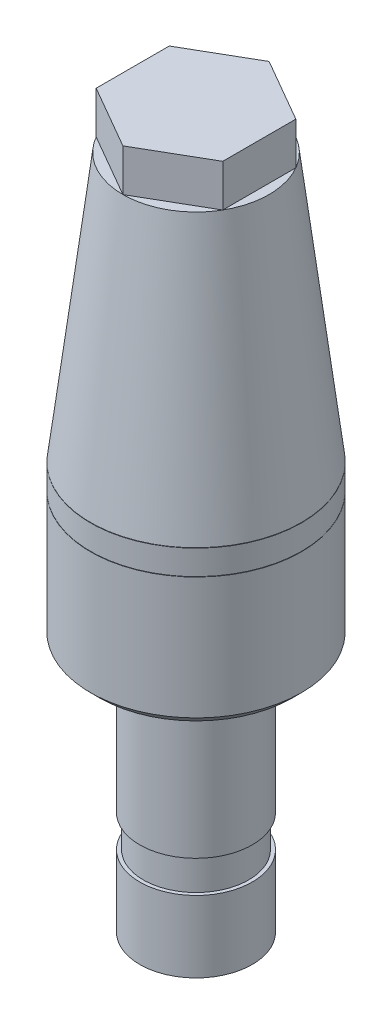
ISO-10303-21;
HEADER;
FILE_DESCRIPTION(('STEP AP214'),'2;1');
FILE_NAME('part.step','',(''),(''),'','','');
FILE_SCHEMA(('AUTOMOTIVE_DESIGN { 1 0 10303 214 1 1 1 1 }'));
ENDSEC;
DATA;
#1=APPLICATION_CONTEXT('core data for automotive mechanical design processes');
#2=APPLICATION_PROTOCOL_DEFINITION('international standard','automotive_design',2000,#1);
#3=PRODUCT_CONTEXT('',#1,'mechanical');
#4=PRODUCT('Part','Part','',(#3));
#5=PRODUCT_RELATED_PRODUCT_CATEGORY('part','',(#4));
#6=PRODUCT_DEFINITION_FORMATION('','',#4);
#7=PRODUCT_DEFINITION_CONTEXT('part definition',#1,'design');
#8=PRODUCT_DEFINITION('design','',#6,#7);
#9=PRODUCT_DEFINITION_SHAPE('','',#8);
#10=(LENGTH_UNIT() NAMED_UNIT(*) SI_UNIT(.MILLI.,.METRE.));
#11=(NAMED_UNIT(*) PLANE_ANGLE_UNIT() SI_UNIT($,.RADIAN.));
#12=(NAMED_UNIT(*) SI_UNIT($,.STERADIAN.) SOLID_ANGLE_UNIT());
#13=UNCERTAINTY_MEASURE_WITH_UNIT(LENGTH_MEASURE(1.E-05),#10,'distance_accuracy_value','');
#14=(GEOMETRIC_REPRESENTATION_CONTEXT(3) GLOBAL_UNCERTAINTY_ASSIGNED_CONTEXT((#13)) GLOBAL_UNIT_ASSIGNED_CONTEXT((#10,
#11,#12)) REPRESENTATION_CONTEXT('',''));
#15=CARTESIAN_POINT('',(0.,0.,0.));
#16=DIRECTION('',(0.,0.,1.));
#17=DIRECTION('',(1.,0.,0.));
#18=AXIS2_PLACEMENT_3D('',#15,#16,#17);
#19=CARTESIAN_POINT('',(4.5,22.5,-2.59807621135331));
#20=DIRECTION('',(0.499999999999999,0.,-0.866025403784439));
#21=DIRECTION('',(-0.866025403784439,0.,-0.499999999999999));
#22=AXIS2_PLACEMENT_3D('',#19,#20,#21);
#23=PLANE('',#22);
#24=DIRECTION('',(-0.866025403784439,0.,-0.499999999999999));
#25=VECTOR('',#24,1.);
#26=CARTESIAN_POINT('',(4.5,25.5,-2.59807621135331));
#27=LINE('',#26,#25);
#28=CARTESIAN_POINT('',(4.5,25.5,-2.59807621135331));
#29=VERTEX_POINT('',#28);
#30=CARTESIAN_POINT('',(0.,25.5,-5.19615242270662));
#31=VERTEX_POINT('',#30);
#32=EDGE_CURVE('E148',#29,#31,#27,.T.);
#33=ORIENTED_EDGE('',*,*,#32,.F.);
#34=DIRECTION('',(0.,1.,0.));
#35=VECTOR('',#34,1.);
#36=CARTESIAN_POINT('',(4.5,22.5,-2.59807621135331));
#37=LINE('',#36,#35);
#38=CARTESIAN_POINT('',(4.5,22.5,-2.59807621135331));
#39=VERTEX_POINT('',#38);
#40=EDGE_CURVE('E12',#39,#29,#37,.T.);
#41=ORIENTED_EDGE('',*,*,#40,.F.);
#42=DIRECTION('',(-0.866025403784439,0.,-0.499999999999999));
#43=VECTOR('',#42,1.);
#44=CARTESIAN_POINT('',(4.5,22.5,-2.59807621135331));
#45=LINE('',#44,#43);
#46=CARTESIAN_POINT('',(0.,22.5,-5.19615242270662));
#47=VERTEX_POINT('',#46);
#48=EDGE_CURVE('E168',#39,#47,#45,.T.);
#49=ORIENTED_EDGE('',*,*,#48,.T.);
#50=DIRECTION('',(0.,1.,0.));
#51=VECTOR('',#50,1.);
#52=CARTESIAN_POINT('',(0.,22.5,-5.19615242270662));
#53=LINE('',#52,#51);
#54=EDGE_CURVE('E59',#47,#31,#53,.T.);
#55=ORIENTED_EDGE('',*,*,#54,.T.);
#56=EDGE_LOOP('',(#33,#41,#49,#55));
#57=FACE_BOUND('',#56,.T.);
#58=ADVANCED_FACE('F56',(#57),#23,.T.);
#59=CARTESIAN_POINT('',(4.5,22.5,2.59807621135331));
#60=DIRECTION('',(1.,0.,0.));
#61=DIRECTION('',(0.,0.,-1.));
#62=AXIS2_PLACEMENT_3D('',#59,#60,#61);
#63=PLANE('',#62);
#64=DIRECTION('',(0.,0.,-1.));
#65=VECTOR('',#64,1.);
#66=CARTESIAN_POINT('',(4.5,25.5,2.59807621135331));
#67=LINE('',#66,#65);
#68=CARTESIAN_POINT('',(4.5,25.5,2.59807621135331));
#69=VERTEX_POINT('',#68);
#70=EDGE_CURVE('E165',#69,#29,#67,.T.);
#71=ORIENTED_EDGE('',*,*,#70,.F.);
#72=DIRECTION('',(0.,1.,0.));
#73=VECTOR('',#72,1.);
#74=CARTESIAN_POINT('',(4.5,22.5,2.59807621135331));
#75=LINE('',#74,#73);
#76=CARTESIAN_POINT('',(4.5,22.5,2.59807621135331));
#77=VERTEX_POINT('',#76);
#78=EDGE_CURVE('E66',#77,#69,#75,.T.);
#79=ORIENTED_EDGE('',*,*,#78,.F.);
#80=DIRECTION('',(0.,0.,-1.));
#81=VECTOR('',#80,1.);
#82=CARTESIAN_POINT('',(4.5,22.5,2.59807621135331));
#83=LINE('',#82,#81);
#84=EDGE_CURVE('E133',#77,#39,#83,.T.);
#85=ORIENTED_EDGE('',*,*,#84,.T.);
#86=ORIENTED_EDGE('',*,*,#40,.T.);
#87=EDGE_LOOP('',(#71,#79,#85,#86));
#88=FACE_BOUND('',#87,.T.);
#89=ADVANCED_FACE('F182',(#88),#63,.T.);
#90=CARTESIAN_POINT('',(0.,22.5,5.19615242270663));
#91=DIRECTION('',(0.5,0.,0.866025403784438));
#92=DIRECTION('',(0.866025403784438,0.,-0.5));
#93=AXIS2_PLACEMENT_3D('',#90,#91,#92);
#94=PLANE('',#93);
#95=DIRECTION('',(0.866025403784438,0.,-0.5));
#96=VECTOR('',#95,1.);
#97=CARTESIAN_POINT('',(0.,25.5,5.19615242270663));
#98=LINE('',#97,#96);
#99=CARTESIAN_POINT('',(0.,25.5,5.19615242270663));
#100=VERTEX_POINT('',#99);
#101=EDGE_CURVE('E119',#100,#69,#98,.T.);
#102=ORIENTED_EDGE('',*,*,#101,.F.);
#103=DIRECTION('',(0.,1.,0.));
#104=VECTOR('',#103,1.);
#105=CARTESIAN_POINT('',(0.,22.5,5.19615242270663));
#106=LINE('',#105,#104);
#107=CARTESIAN_POINT('',(0.,22.5,5.19615242270663));
#108=VERTEX_POINT('',#107);
#109=EDGE_CURVE('E114',#108,#100,#106,.T.);
#110=ORIENTED_EDGE('',*,*,#109,.F.);
#111=DIRECTION('',(0.866025403784438,0.,-0.5));
#112=VECTOR('',#111,1.);
#113=CARTESIAN_POINT('',(0.,22.5,5.19615242270663));
#114=LINE('',#113,#112);
#115=EDGE_CURVE('E117',#108,#77,#114,.T.);
#116=ORIENTED_EDGE('',*,*,#115,.T.);
#117=ORIENTED_EDGE('',*,*,#78,.T.);
#118=EDGE_LOOP('',(#102,#110,#116,#117));
#119=FACE_BOUND('',#118,.T.);
#120=ADVANCED_FACE('F116',(#119),#94,.T.);
#121=CARTESIAN_POINT('',(-4.5,22.5,2.59807621135331));
#122=DIRECTION('',(-0.5,0.,0.866025403784439));
#123=DIRECTION('',(0.866025403784439,0.,0.5));
#124=AXIS2_PLACEMENT_3D('',#121,#122,#123);
#125=PLANE('',#124);
#126=DIRECTION('',(0.866025403784439,0.,0.499999999999999));
#127=VECTOR('',#126,1.);
#128=CARTESIAN_POINT('',(-4.5,25.5,2.59807621135332));
#129=LINE('',#128,#127);
#130=CARTESIAN_POINT('',(-4.5,25.5,2.59807621135332));
#131=VERTEX_POINT('',#130);
#132=EDGE_CURVE('E160',#131,#100,#129,.T.);
#133=ORIENTED_EDGE('',*,*,#132,.F.);
#134=DIRECTION('',(0.,1.,0.));
#135=VECTOR('',#134,1.);
#136=CARTESIAN_POINT('',(-4.5,22.5,2.59807621135331));
#137=LINE('',#136,#135);
#138=CARTESIAN_POINT('',(-4.5,22.5,2.59807621135331));
#139=VERTEX_POINT('',#138);
#140=EDGE_CURVE('E125',#139,#131,#137,.T.);
#141=ORIENTED_EDGE('',*,*,#140,.F.);
#142=DIRECTION('',(0.866025403784439,0.,0.499999999999999));
#143=VECTOR('',#142,1.);
#144=CARTESIAN_POINT('',(-4.5,22.5,2.59807621135331));
#145=LINE('',#144,#143);
#146=EDGE_CURVE('E131',#139,#108,#145,.T.);
#147=ORIENTED_EDGE('',*,*,#146,.T.);
#148=ORIENTED_EDGE('',*,*,#109,.T.);
#149=EDGE_LOOP('',(#133,#141,#147,#148));
#150=FACE_BOUND('',#149,.T.);
#151=ADVANCED_FACE('F136',(#150),#125,.T.);
#152=CARTESIAN_POINT('',(-4.5,22.5,-2.59807621135331));
#153=DIRECTION('',(-1.,0.,0.));
#154=DIRECTION('',(0.,0.,1.));
#155=AXIS2_PLACEMENT_3D('',#152,#153,#154);
#156=PLANE('',#155);
#157=DIRECTION('',(0.,0.,1.));
#158=VECTOR('',#157,1.);
#159=CARTESIAN_POINT('',(-4.5,25.5,-2.59807621135331));
#160=LINE('',#159,#158);
#161=CARTESIAN_POINT('',(-4.5,25.5,-2.59807621135331));
#162=VERTEX_POINT('',#161);
#163=EDGE_CURVE('E156',#162,#131,#160,.T.);
#164=ORIENTED_EDGE('',*,*,#163,.F.);
#165=DIRECTION('',(0.,1.,0.));
#166=VECTOR('',#165,1.);
#167=CARTESIAN_POINT('',(-4.5,22.5,-2.59807621135331));
#168=LINE('',#167,#166);
#169=CARTESIAN_POINT('',(-4.5,22.5,-2.59807621135331));
#170=VERTEX_POINT('',#169);
#171=EDGE_CURVE('E173',#170,#162,#168,.T.);
#172=ORIENTED_EDGE('',*,*,#171,.F.);
#173=DIRECTION('',(0.,0.,1.));
#174=VECTOR('',#173,1.);
#175=CARTESIAN_POINT('',(-4.5,22.5,-2.59807621135331));
#176=LINE('',#175,#174);
#177=EDGE_CURVE('E138',#170,#139,#176,.T.);
#178=ORIENTED_EDGE('',*,*,#177,.T.);
#179=ORIENTED_EDGE('',*,*,#140,.T.);
#180=EDGE_LOOP('',(#164,#172,#178,#179));
#181=FACE_BOUND('',#180,.T.);
#182=ADVANCED_FACE('F195',(#181),#156,.T.);
#183=CARTESIAN_POINT('',(0.,22.5,-5.19615242270662));
#184=DIRECTION('',(-0.5,0.,-0.866025403784439));
#185=DIRECTION('',(-0.866025403784439,0.,0.5));
#186=AXIS2_PLACEMENT_3D('',#183,#184,#185);
#187=PLANE('',#186);
#188=DIRECTION('',(-0.866025403784438,0.,0.5));
#189=VECTOR('',#188,1.);
#190=CARTESIAN_POINT('',(0.,25.5,-5.19615242270662));
#191=LINE('',#190,#189);
#192=EDGE_CURVE('E152',#31,#162,#191,.T.);
#193=ORIENTED_EDGE('',*,*,#192,.F.);
#194=ORIENTED_EDGE('',*,*,#54,.F.);
#195=DIRECTION('',(-0.866025403784438,0.,0.5));
#196=VECTOR('',#195,1.);
#197=CARTESIAN_POINT('',(0.,22.5,-5.19615242270662));
#198=LINE('',#197,#196);
#199=EDGE_CURVE('E142',#47,#170,#198,.T.);
#200=ORIENTED_EDGE('',*,*,#199,.T.);
#201=ORIENTED_EDGE('',*,*,#171,.T.);
#202=EDGE_LOOP('',(#193,#194,#200,#201));
#203=FACE_BOUND('',#202,.T.);
#204=ADVANCED_FACE('F179',(#203),#187,.T.);
#205=CARTESIAN_POINT('',(0.,22.5,0.));
#206=DIRECTION('',(0.,1.,0.));
#207=DIRECTION('',(0.,0.,1.));
#208=AXIS2_PLACEMENT_3D('',#205,#206,#207);
#209=PLANE('',#208);
#210=ORIENTED_EDGE('',*,*,#48,.F.);
#211=ORIENTED_EDGE('',*,*,#84,.F.);
#212=ORIENTED_EDGE('',*,*,#115,.F.);
#213=ORIENTED_EDGE('',*,*,#146,.F.);
#214=ORIENTED_EDGE('',*,*,#177,.F.);
#215=ORIENTED_EDGE('',*,*,#199,.F.);
#216=EDGE_LOOP('',(#210,#211,#212,#213,#214,#215));
#217=FACE_BOUND('',#216,.T.);
#218=ADVANCED_FACE('F129',(#217),#209,.F.);
#219=CARTESIAN_POINT('',(0.,25.5,0.));
#220=DIRECTION('',(0.,1.,0.));
#221=DIRECTION('',(0.,0.,1.));
#222=AXIS2_PLACEMENT_3D('',#219,#220,#221);
#223=PLANE('',#222);
#224=ORIENTED_EDGE('',*,*,#32,.T.);
#225=ORIENTED_EDGE('',*,*,#192,.T.);
#226=ORIENTED_EDGE('',*,*,#163,.T.);
#227=ORIENTED_EDGE('',*,*,#132,.T.);
#228=ORIENTED_EDGE('',*,*,#101,.T.);
#229=ORIENTED_EDGE('',*,*,#70,.T.);
#230=EDGE_LOOP('',(#224,#225,#226,#227,#228,#229));
#231=FACE_BOUND('',#230,.T.);
#232=ADVANCED_FACE('F181',(#231),#223,.T.);
#233=CLOSED_SHELL('',(#58,#89,#120,#151,#182,#204,#218,#232));
#234=MANIFOLD_SOLID_BREP('B2',#233);
#235=CARTESIAN_POINT('',(-5.19615242270663,22.5,0.));
#236=DIRECTION('',(0.,1.,0.));
#237=DIRECTION('',(-1.,0.,0.));
#238=AXIS2_PLACEMENT_3D('',#235,#236,#237);
#239=PLANE('',#238);
#240=CARTESIAN_POINT('',(0.,22.5,0.));
#241=DIRECTION('',(0.,1.,0.));
#242=DIRECTION('',(-1.,0.,0.));
#243=AXIS2_PLACEMENT_3D('',#240,#241,#242);
#244=CIRCLE('',#243,5.19615242270663);
#245=CARTESIAN_POINT('',(-5.19615242270663,22.5,0.));
#246=VERTEX_POINT('',#245);
#247=EDGE_CURVE('E267',#246,#246,#244,.T.);
#248=ORIENTED_EDGE('',*,*,#247,.T.);
#249=EDGE_LOOP('',(#248));
#250=FACE_BOUND('',#249,.T.);
#251=ADVANCED_FACE('F260',(#250),#239,.T.);
#252=CARTESIAN_POINT('',(-7.50000000000001,3.46250000000001,0.));
#253=DIRECTION('',(0.,-1.,0.));
#254=DIRECTION('',(1.,0.,0.));
#255=AXIS2_PLACEMENT_3D('',#252,#253,#254);
#256=PLANE('',#255);
#257=CARTESIAN_POINT('',(0.,3.46250000000001,0.));
#258=DIRECTION('',(0.,1.,0.));
#259=DIRECTION('',(-1.,0.,0.));
#260=AXIS2_PLACEMENT_3D('',#257,#258,#259);
#261=CIRCLE('',#260,6.23);
#262=CARTESIAN_POINT('',(-6.23,3.46250000000001,0.));
#263=VERTEX_POINT('',#262);
#264=EDGE_CURVE('E273',#263,#263,#261,.T.);
#265=ORIENTED_EDGE('',*,*,#264,.T.);
#266=EDGE_LOOP('',(#265));
#267=FACE_BOUND('',#266,.T.);
#268=CARTESIAN_POINT('',(0.,3.46250000000001,0.));
#269=DIRECTION('',(0.,1.,0.));
#270=DIRECTION('',(-1.,0.,0.));
#271=AXIS2_PLACEMENT_3D('',#268,#269,#270);
#272=CIRCLE('',#271,7.5);
#273=CARTESIAN_POINT('',(-7.5,3.46250000000001,0.));
#274=VERTEX_POINT('',#273);
#275=EDGE_CURVE('E55',#274,#274,#272,.T.);
#276=ORIENTED_EDGE('',*,*,#275,.F.);
#277=EDGE_LOOP('',(#276));
#278=FACE_BOUND('',#277,.T.);
#279=ADVANCED_FACE('F299',(#267,#278),#256,.T.);
#280=CARTESIAN_POINT('',(0.,22.5,0.));
#281=DIRECTION('',(0.,-1.,0.));
#282=DIRECTION('',(1.,0.,0.));
#283=AXIS2_PLACEMENT_3D('',#280,#281,#282);
#284=CONICAL_SURFACE('',#283,5.19615242270663,0.120430666164298);
#285=ORIENTED_EDGE('',*,*,#275,.T.);
#286=EDGE_LOOP('',(#285));
#287=FACE_BOUND('',#286,.T.);
#288=ORIENTED_EDGE('',*,*,#247,.F.);
#289=EDGE_LOOP('',(#288));
#290=FACE_BOUND('',#289,.T.);
#291=ADVANCED_FACE('F295',(#287,#290),#284,.T.);
#292=CARTESIAN_POINT('',(0.,21.23,0.));
#293=DIRECTION('',(0.,-1.,0.));
#294=DIRECTION('',(1.,0.,0.));
#295=AXIS2_PLACEMENT_3D('',#292,#293,#294);
#296=CONICAL_SURFACE('',#295,4.07984310809929,0.120430666164298);
#297=ORIENTED_EDGE('',*,*,#264,.F.);
#298=EDGE_LOOP('',(#297));
#299=FACE_BOUND('',#298,.T.);
#300=CARTESIAN_POINT('',(0.,21.23,0.));
#301=DIRECTION('',(0.,1.,0.));
#302=DIRECTION('',(-1.,0.,0.));
#303=AXIS2_PLACEMENT_3D('',#300,#301,#302);
#304=CIRCLE('',#303,4.07984310809929);
#305=CARTESIAN_POINT('',(-4.07984310809929,21.23,0.));
#306=VERTEX_POINT('',#305);
#307=EDGE_CURVE('E279',#306,#306,#304,.T.);
#308=ORIENTED_EDGE('',*,*,#307,.T.);
#309=EDGE_LOOP('',(#308));
#310=FACE_BOUND('',#309,.T.);
#311=ADVANCED_FACE('F287',(#299,#310),#296,.F.);
#312=CARTESIAN_POINT('',(-4.07984310809928,21.23,0.));
#313=DIRECTION('',(0.,1.,0.));
#314=DIRECTION('',(-1.,0.,0.));
#315=AXIS2_PLACEMENT_3D('',#312,#313,#314);
#316=PLANE('',#315);
#317=ORIENTED_EDGE('',*,*,#307,.F.);
#318=EDGE_LOOP('',(#317));
#319=FACE_BOUND('',#318,.T.);
#320=ADVANCED_FACE('F289',(#319),#316,.F.);
#321=CLOSED_SHELL('',(#251,#279,#291,#311,#320));
#322=MANIFOLD_SOLID_BREP('B6',#321);
#323=CARTESIAN_POINT('',(-7.50000000000001,3.43710000000001,0.));
#324=DIRECTION('',(0.,1.,0.));
#325=DIRECTION('',(-1.,0.,0.));
#326=AXIS2_PLACEMENT_3D('',#323,#324,#325);
#327=PLANE('',#326);
#328=CARTESIAN_POINT('',(0.,3.43710000000001,0.));
#329=DIRECTION('',(0.,1.,0.));
#330=DIRECTION('',(-1.,0.,0.));
#331=AXIS2_PLACEMENT_3D('',#328,#329,#330);
#332=CIRCLE('',#331,6.23);
#333=CARTESIAN_POINT('',(-6.23,3.4371,0.));
#334=VERTEX_POINT('',#333);
#335=EDGE_CURVE('E350',#334,#334,#332,.T.);
#336=ORIENTED_EDGE('',*,*,#335,.F.);
#337=EDGE_LOOP('',(#336));
#338=FACE_BOUND('',#337,.T.);
#339=CARTESIAN_POINT('',(0.,3.43710000000001,0.));
#340=DIRECTION('',(0.,1.,0.));
#341=DIRECTION('',(-1.,0.,0.));
#342=AXIS2_PLACEMENT_3D('',#339,#340,#341);
#343=CIRCLE('',#342,7.5);
#344=CARTESIAN_POINT('',(-7.5,3.4371,0.));
#345=VERTEX_POINT('',#344);
#346=EDGE_CURVE('E344',#345,#345,#343,.T.);
#347=ORIENTED_EDGE('',*,*,#346,.T.);
#348=EDGE_LOOP('',(#347));
#349=FACE_BOUND('',#348,.T.);
#350=ADVANCED_FACE('F336',(#338,#349),#327,.T.);
#351=CARTESIAN_POINT('',(-7.50000000000001,1.68450000000001,0.));
#352=DIRECTION('',(0.,-1.,0.));
#353=DIRECTION('',(1.,0.,0.));
#354=AXIS2_PLACEMENT_3D('',#351,#352,#353);
#355=PLANE('',#354);
#356=CARTESIAN_POINT('',(0.,1.68450000000001,0.));
#357=DIRECTION('',(0.,-1.,0.));
#358=DIRECTION('',(1.,0.,0.));
#359=AXIS2_PLACEMENT_3D('',#356,#357,#358);
#360=CIRCLE('',#359,6.23);
#361=CARTESIAN_POINT('',(6.23,1.68450000000001,0.));
#362=VERTEX_POINT('',#361);
#363=EDGE_CURVE('E339',#362,#362,#360,.T.);
#364=ORIENTED_EDGE('',*,*,#363,.F.);
#365=EDGE_LOOP('',(#364));
#366=FACE_BOUND('',#365,.T.);
#367=CARTESIAN_POINT('',(0.,1.68450000000001,0.));
#368=DIRECTION('',(0.,1.,0.));
#369=DIRECTION('',(-1.,0.,0.));
#370=AXIS2_PLACEMENT_3D('',#367,#368,#369);
#371=CIRCLE('',#370,7.5);
#372=CARTESIAN_POINT('',(-7.5,1.68450000000001,0.));
#373=VERTEX_POINT('',#372);
#374=EDGE_CURVE('E259',#373,#373,#371,.T.);
#375=ORIENTED_EDGE('',*,*,#374,.F.);
#376=EDGE_LOOP('',(#375));
#377=FACE_BOUND('',#376,.T.);
#378=ADVANCED_FACE('F365',(#366,#377),#355,.T.);
#379=CARTESIAN_POINT('',(0.,22.5,0.));
#380=DIRECTION('',(0.,1.,0.));
#381=DIRECTION('',(-1.,0.,0.));
#382=AXIS2_PLACEMENT_3D('',#379,#380,#381);
#383=CYLINDRICAL_SURFACE('',#382,7.5);
#384=ORIENTED_EDGE('',*,*,#374,.T.);
#385=EDGE_LOOP('',(#384));
#386=FACE_BOUND('',#385,.T.);
#387=ORIENTED_EDGE('',*,*,#346,.F.);
#388=EDGE_LOOP('',(#387));
#389=FACE_BOUND('',#388,.T.);
#390=ADVANCED_FACE('F368',(#386,#389),#383,.T.);
#391=CARTESIAN_POINT('',(0.,21.23,0.));
#392=DIRECTION('',(0.,1.,0.));
#393=DIRECTION('',(-1.,0.,0.));
#394=AXIS2_PLACEMENT_3D('',#391,#392,#393);
#395=CYLINDRICAL_SURFACE('',#394,6.23);
#396=ORIENTED_EDGE('',*,*,#335,.T.);
#397=EDGE_LOOP('',(#396));
#398=FACE_BOUND('',#397,.T.);
#399=ORIENTED_EDGE('',*,*,#363,.T.);
#400=EDGE_LOOP('',(#399));
#401=FACE_BOUND('',#400,.T.);
#402=ADVANCED_FACE('F363',(#398,#401),#395,.F.);
#403=CLOSED_SHELL('',(#350,#378,#390,#402));
#404=MANIFOLD_SOLID_BREP('B50',#403);
#405=CARTESIAN_POINT('',(-4.,-25.5,1.31838984174237E-13));
#406=DIRECTION('',(0.,-1.,0.));
#407=DIRECTION('',(1.,0.,0.));
#408=AXIS2_PLACEMENT_3D('',#405,#406,#407);
#409=PLANE('',#408);
#410=CARTESIAN_POINT('',(0.,-25.5,1.31838984174237E-13));
#411=DIRECTION('',(0.,1.,0.));
#412=DIRECTION('',(-1.,0.,0.));
#413=AXIS2_PLACEMENT_3D('',#410,#411,#412);
#414=CIRCLE('',#413,2.857);
#415=CARTESIAN_POINT('',(-2.857,-25.5,1.31838984174237E-13));
#416=VERTEX_POINT('',#415);
#417=EDGE_CURVE('E335',#416,#416,#414,.T.);
#418=ORIENTED_EDGE('',*,*,#417,.T.);
#419=EDGE_LOOP('',(#418));
#420=FACE_BOUND('',#419,.T.);
#421=CARTESIAN_POINT('',(0.,-25.5,1.31838984174237E-13));
#422=DIRECTION('',(0.,1.,0.));
#423=DIRECTION('',(-1.,0.,0.));
#424=AXIS2_PLACEMENT_3D('',#421,#422,#423);
#425=CIRCLE('',#424,4.);
#426=CARTESIAN_POINT('',(-4.,-25.5,1.31838984174237E-13));
#427=VERTEX_POINT('',#426);
#428=EDGE_CURVE('E442',#427,#427,#425,.T.);
#429=ORIENTED_EDGE('',*,*,#428,.F.);
#430=EDGE_LOOP('',(#429));
#431=FACE_BOUND('',#430,.T.);
#432=ADVANCED_FACE('F398',(#420,#431),#409,.T.);
#433=CARTESIAN_POINT('',(0.,22.5,0.));
#434=DIRECTION('',(0.,1.,0.));
#435=DIRECTION('',(-1.,0.,0.));
#436=AXIS2_PLACEMENT_3D('',#433,#434,#435);
#437=CYLINDRICAL_SURFACE('',#436,2.857);
#438=CARTESIAN_POINT('',(0.,-7.64999999999999,0.));
#439=DIRECTION('',(0.,1.,0.));
#440=DIRECTION('',(-1.,0.,0.));
#441=AXIS2_PLACEMENT_3D('',#438,#439,#440);
#442=CIRCLE('',#441,2.857);
#443=CARTESIAN_POINT('',(-2.857,-7.64999999999999,0.));
#444=VERTEX_POINT('',#443);
#445=EDGE_CURVE('E446',#444,#444,#442,.T.);
#446=ORIENTED_EDGE('',*,*,#445,.T.);
#447=EDGE_LOOP('',(#446));
#448=FACE_BOUND('',#447,.T.);
#449=ORIENTED_EDGE('',*,*,#417,.F.);
#450=EDGE_LOOP('',(#449));
#451=FACE_BOUND('',#450,.T.);
#452=ADVANCED_FACE('F470',(#448,#451),#437,.F.);
#453=CARTESIAN_POINT('',(-7.50000000000001,1.65910000000001,0.));
#454=DIRECTION('',(0.,1.,0.));
#455=DIRECTION('',(-1.,0.,0.));
#456=AXIS2_PLACEMENT_3D('',#453,#454,#455);
#457=PLANE('',#456);
#458=CARTESIAN_POINT('',(0.,1.6591,0.));
#459=DIRECTION('',(0.,1.,0.));
#460=DIRECTION('',(-1.,0.,0.));
#461=AXIS2_PLACEMENT_3D('',#458,#459,#460);
#462=CIRCLE('',#461,6.23);
#463=CARTESIAN_POINT('',(-6.23,1.6591,0.));
#464=VERTEX_POINT('',#463);
#465=EDGE_CURVE('E401',#464,#464,#462,.T.);
#466=ORIENTED_EDGE('',*,*,#465,.F.);
#467=EDGE_LOOP('',(#466));
#468=FACE_BOUND('',#467,.T.);
#469=CARTESIAN_POINT('',(0.,1.6591,0.));
#470=DIRECTION('',(0.,1.,0.));
#471=DIRECTION('',(-1.,0.,0.));
#472=AXIS2_PLACEMENT_3D('',#469,#470,#471);
#473=CIRCLE('',#472,7.5);
#474=CARTESIAN_POINT('',(-7.5,1.6591,0.));
#475=VERTEX_POINT('',#474);
#476=EDGE_CURVE('E406',#475,#475,#473,.T.);
#477=ORIENTED_EDGE('',*,*,#476,.T.);
#478=EDGE_LOOP('',(#477));
#479=FACE_BOUND('',#478,.T.);
#480=ADVANCED_FACE('F474',(#468,#479),#457,.T.);
#481=CARTESIAN_POINT('',(0.,22.5,0.));
#482=DIRECTION('',(0.,1.,0.));
#483=DIRECTION('',(-1.,0.,0.));
#484=AXIS2_PLACEMENT_3D('',#481,#482,#483);
#485=CYLINDRICAL_SURFACE('',#484,7.5);
#486=CARTESIAN_POINT('',(0.,-7.01499999999999,0.));
#487=DIRECTION('',(0.,1.,0.));
#488=DIRECTION('',(-1.,0.,0.));
#489=AXIS2_PLACEMENT_3D('',#486,#487,#488);
#490=CIRCLE('',#489,7.5);
#491=CARTESIAN_POINT('',(-7.5,-7.01499999999999,0.));
#492=VERTEX_POINT('',#491);
#493=EDGE_CURVE('E412',#492,#492,#490,.T.);
#494=ORIENTED_EDGE('',*,*,#493,.T.);
#495=EDGE_LOOP('',(#494));
#496=FACE_BOUND('',#495,.T.);
#497=ORIENTED_EDGE('',*,*,#476,.F.);
#498=EDGE_LOOP('',(#497));
#499=FACE_BOUND('',#498,.T.);
#500=ADVANCED_FACE('F517',(#496,#499),#485,.T.);
#501=CARTESIAN_POINT('',(0.,-7.01499999999999,0.));
#502=DIRECTION('',(0.,1.,0.));
#503=DIRECTION('',(-1.,0.,0.));
#504=AXIS2_PLACEMENT_3D('',#501,#502,#503);
#505=CONICAL_SURFACE('',#504,7.5,0.785398163397446);
#506=CARTESIAN_POINT('',(0.,-7.64999999999999,0.));
#507=DIRECTION('',(0.,1.,0.));
#508=DIRECTION('',(-1.,0.,0.));
#509=AXIS2_PLACEMENT_3D('',#506,#507,#508);
#510=CIRCLE('',#509,6.865);
#511=CARTESIAN_POINT('',(-6.865,-7.64999999999999,0.));
#512=VERTEX_POINT('',#511);
#513=EDGE_CURVE('E418',#512,#512,#510,.T.);
#514=ORIENTED_EDGE('',*,*,#513,.T.);
#515=EDGE_LOOP('',(#514));
#516=FACE_BOUND('',#515,.T.);
#517=ORIENTED_EDGE('',*,*,#493,.F.);
#518=EDGE_LOOP('',(#517));
#519=FACE_BOUND('',#518,.T.);
#520=ADVANCED_FACE('F511',(#516,#519),#505,.T.);
#521=CARTESIAN_POINT('',(-4.,-7.64999999999999,0.));
#522=DIRECTION('',(0.,-1.,0.));
#523=DIRECTION('',(1.,0.,0.));
#524=AXIS2_PLACEMENT_3D('',#521,#522,#523);
#525=PLANE('',#524);
#526=CARTESIAN_POINT('',(0.,-7.64999999999999,0.));
#527=DIRECTION('',(0.,1.,0.));
#528=DIRECTION('',(-1.,0.,0.));
#529=AXIS2_PLACEMENT_3D('',#526,#527,#528);
#530=CIRCLE('',#529,4.);
#531=CARTESIAN_POINT('',(-4.,-7.64999999999999,0.));
#532=VERTEX_POINT('',#531);
#533=EDGE_CURVE('E422',#532,#532,#530,.T.);
#534=ORIENTED_EDGE('',*,*,#533,.T.);
#535=EDGE_LOOP('',(#534));
#536=FACE_BOUND('',#535,.T.);
#537=ORIENTED_EDGE('',*,*,#513,.F.);
#538=EDGE_LOOP('',(#537));
#539=FACE_BOUND('',#538,.T.);
#540=ADVANCED_FACE('F505',(#536,#539),#525,.T.);
#541=CARTESIAN_POINT('',(0.,22.5,0.));
#542=DIRECTION('',(0.,1.,0.));
#543=DIRECTION('',(-1.,0.,0.));
#544=AXIS2_PLACEMENT_3D('',#541,#542,#543);
#545=CYLINDRICAL_SURFACE('',#544,4.);
#546=CARTESIAN_POINT('',(0.,-18.134,0.));
#547=DIRECTION('',(0.,1.,0.));
#548=DIRECTION('',(-1.,0.,0.));
#549=AXIS2_PLACEMENT_3D('',#546,#547,#548);
#550=CIRCLE('',#549,4.);
#551=CARTESIAN_POINT('',(-4.,-18.134,0.));
#552=VERTEX_POINT('',#551);
#553=EDGE_CURVE('E426',#552,#552,#550,.T.);
#554=ORIENTED_EDGE('',*,*,#553,.T.);
#555=EDGE_LOOP('',(#554));
#556=FACE_BOUND('',#555,.T.);
#557=ORIENTED_EDGE('',*,*,#533,.F.);
#558=EDGE_LOOP('',(#557));
#559=FACE_BOUND('',#558,.T.);
#560=ADVANCED_FACE('F499',(#556,#559),#545,.T.);
#561=CARTESIAN_POINT('',(-4.,-18.134,0.));
#562=DIRECTION('',(0.,-1.,0.));
#563=DIRECTION('',(1.,0.,0.));
#564=AXIS2_PLACEMENT_3D('',#561,#562,#563);
#565=PLANE('',#564);
#566=CARTESIAN_POINT('',(0.,-18.134,0.));
#567=DIRECTION('',(0.,1.,0.));
#568=DIRECTION('',(-1.,0.,0.));
#569=AXIS2_PLACEMENT_3D('',#566,#567,#568);
#570=CIRCLE('',#569,3.746);
#571=CARTESIAN_POINT('',(-3.746,-18.134,0.));
#572=VERTEX_POINT('',#571);
#573=EDGE_CURVE('E430',#572,#572,#570,.T.);
#574=ORIENTED_EDGE('',*,*,#573,.T.);
#575=EDGE_LOOP('',(#574));
#576=FACE_BOUND('',#575,.T.);
#577=ORIENTED_EDGE('',*,*,#553,.F.);
#578=EDGE_LOOP('',(#577));
#579=FACE_BOUND('',#578,.T.);
#580=ADVANCED_FACE('F493',(#576,#579),#565,.T.);
#581=CARTESIAN_POINT('',(0.,22.5,0.));
#582=DIRECTION('',(0.,1.,0.));
#583=DIRECTION('',(-1.,0.,0.));
#584=AXIS2_PLACEMENT_3D('',#581,#582,#583);
#585=CYLINDRICAL_SURFACE('',#584,3.746);
#586=CARTESIAN_POINT('',(0.,-20.42,0.));
#587=DIRECTION('',(0.,1.,0.));
#588=DIRECTION('',(-1.,0.,0.));
#589=AXIS2_PLACEMENT_3D('',#586,#587,#588);
#590=CIRCLE('',#589,3.746);
#591=CARTESIAN_POINT('',(-3.746,-20.42,0.));
#592=VERTEX_POINT('',#591);
#593=EDGE_CURVE('E434',#592,#592,#590,.T.);
#594=ORIENTED_EDGE('',*,*,#593,.T.);
#595=EDGE_LOOP('',(#594));
#596=FACE_BOUND('',#595,.T.);
#597=ORIENTED_EDGE('',*,*,#573,.F.);
#598=EDGE_LOOP('',(#597));
#599=FACE_BOUND('',#598,.T.);
#600=ADVANCED_FACE('F487',(#596,#599),#585,.T.);
#601=CARTESIAN_POINT('',(-3.746,-20.42,0.));
#602=DIRECTION('',(0.,1.,0.));
#603=DIRECTION('',(-1.,0.,0.));
#604=AXIS2_PLACEMENT_3D('',#601,#602,#603);
#605=PLANE('',#604);
#606=CARTESIAN_POINT('',(0.,-20.42,0.));
#607=DIRECTION('',(0.,1.,0.));
#608=DIRECTION('',(-1.,0.,0.));
#609=AXIS2_PLACEMENT_3D('',#606,#607,#608);
#610=CIRCLE('',#609,4.);
#611=CARTESIAN_POINT('',(-4.,-20.42,0.));
#612=VERTEX_POINT('',#611);
#613=EDGE_CURVE('E438',#612,#612,#610,.T.);
#614=ORIENTED_EDGE('',*,*,#613,.T.);
#615=EDGE_LOOP('',(#614));
#616=FACE_BOUND('',#615,.T.);
#617=ORIENTED_EDGE('',*,*,#593,.F.);
#618=EDGE_LOOP('',(#617));
#619=FACE_BOUND('',#618,.T.);
#620=ADVANCED_FACE('F481',(#616,#619),#605,.T.);
#621=CARTESIAN_POINT('',(0.,22.5,0.));
#622=DIRECTION('',(0.,1.,0.));
#623=DIRECTION('',(-1.,0.,0.));
#624=AXIS2_PLACEMENT_3D('',#621,#622,#623);
#625=CYLINDRICAL_SURFACE('',#624,4.);
#626=ORIENTED_EDGE('',*,*,#428,.T.);
#627=EDGE_LOOP('',(#626));
#628=FACE_BOUND('',#627,.T.);
#629=ORIENTED_EDGE('',*,*,#613,.F.);
#630=EDGE_LOOP('',(#629));
#631=FACE_BOUND('',#630,.T.);
#632=ADVANCED_FACE('F465',(#628,#631),#625,.T.);
#633=CARTESIAN_POINT('',(0.,-4.27699999999998,0.));
#634=DIRECTION('',(0.,1.,0.));
#635=DIRECTION('',(-1.,0.,0.));
#636=AXIS2_PLACEMENT_3D('',#633,#634,#635);
#637=CONICAL_SURFACE('',#636,6.23,0.785398163397447);
#638=ORIENTED_EDGE('',*,*,#445,.F.);
#639=EDGE_LOOP('',(#638));
#640=FACE_BOUND('',#639,.T.);
#641=CARTESIAN_POINT('',(0.,-4.27699999999998,0.));
#642=DIRECTION('',(0.,1.,0.));
#643=DIRECTION('',(-1.,0.,0.));
#644=AXIS2_PLACEMENT_3D('',#641,#642,#643);
#645=CIRCLE('',#644,6.23);
#646=CARTESIAN_POINT('',(-6.23,-4.27699999999997,0.));
#647=VERTEX_POINT('',#646);
#648=EDGE_CURVE('E450',#647,#647,#645,.T.);
#649=ORIENTED_EDGE('',*,*,#648,.T.);
#650=EDGE_LOOP('',(#649));
#651=FACE_BOUND('',#650,.T.);
#652=ADVANCED_FACE('F456',(#640,#651),#637,.F.);
#653=CARTESIAN_POINT('',(0.,21.23,0.));
#654=DIRECTION('',(0.,1.,0.));
#655=DIRECTION('',(-1.,0.,0.));
#656=AXIS2_PLACEMENT_3D('',#653,#654,#655);
#657=CYLINDRICAL_SURFACE('',#656,6.23);
#658=ORIENTED_EDGE('',*,*,#465,.T.);
#659=EDGE_LOOP('',(#658));
#660=FACE_BOUND('',#659,.T.);
#661=ORIENTED_EDGE('',*,*,#648,.F.);
#662=EDGE_LOOP('',(#661));
#663=FACE_BOUND('',#662,.T.);
#664=ADVANCED_FACE('F458',(#660,#663),#657,.F.);
#665=CLOSED_SHELL('',(#432,#452,#480,#500,#520,#540,#560,#580,#600,#620,#632,#652,#664));
#666=MANIFOLD_SOLID_BREP('B254',#665);
#667=ADVANCED_BREP_SHAPE_REPRESENTATION('',(#18,#234,#322,#404,#666),#14);
#668=SHAPE_DEFINITION_REPRESENTATION(#9,#667);
ENDSEC;
END-ISO-10303-21;
